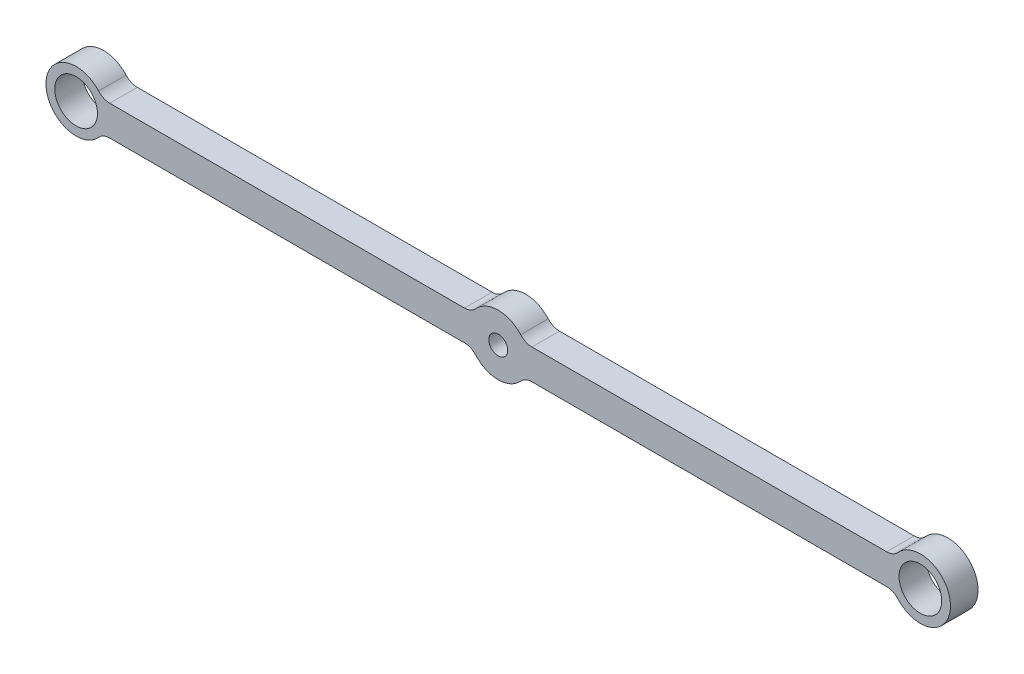
ISO-10303-21;
HEADER;
FILE_DESCRIPTION(('STEP AP214'),'2;1');
FILE_NAME('part.step','',(''),(''),'','','');
FILE_SCHEMA(('AUTOMOTIVE_DESIGN { 1 0 10303 214 1 1 1 1 }'));
ENDSEC;
DATA;
#1=APPLICATION_CONTEXT('core data for automotive mechanical design processes');
#2=APPLICATION_PROTOCOL_DEFINITION('international standard','automotive_design',2000,#1);
#3=PRODUCT_CONTEXT('',#1,'mechanical');
#4=PRODUCT('Part','Part','',(#3));
#5=PRODUCT_RELATED_PRODUCT_CATEGORY('part','',(#4));
#6=PRODUCT_DEFINITION_FORMATION('','',#4);
#7=PRODUCT_DEFINITION_CONTEXT('part definition',#1,'design');
#8=PRODUCT_DEFINITION('design','',#6,#7);
#9=PRODUCT_DEFINITION_SHAPE('','',#8);
#10=(LENGTH_UNIT() NAMED_UNIT(*) SI_UNIT(.MILLI.,.METRE.));
#11=(NAMED_UNIT(*) PLANE_ANGLE_UNIT() SI_UNIT($,.RADIAN.));
#12=(NAMED_UNIT(*) SI_UNIT($,.STERADIAN.) SOLID_ANGLE_UNIT());
#13=UNCERTAINTY_MEASURE_WITH_UNIT(LENGTH_MEASURE(1.E-05),#10,'distance_accuracy_value','');
#14=(GEOMETRIC_REPRESENTATION_CONTEXT(3) GLOBAL_UNCERTAINTY_ASSIGNED_CONTEXT((#13)) GLOBAL_UNIT_ASSIGNED_CONTEXT((#10,
#11,#12)) REPRESENTATION_CONTEXT('',''));
#15=CARTESIAN_POINT('',(0.,0.,0.));
#16=DIRECTION('',(0.,0.,1.));
#17=DIRECTION('',(1.,0.,0.));
#18=AXIS2_PLACEMENT_3D('',#15,#16,#17);
#19=CARTESIAN_POINT('',(-88.9000000000009,0.,5.80136));
#20=DIRECTION('',(0.,0.,-1.));
#21=DIRECTION('',(-1.,0.,0.));
#22=AXIS2_PLACEMENT_3D('',#19,#20,#21);
#23=CYLINDRICAL_SURFACE('',#22,6.35);
#24=CARTESIAN_POINT('',(-88.9000000000009,0.,0.));
#25=DIRECTION('',(0.,0.,1.));
#26=DIRECTION('',(1.,0.,0.));
#27=AXIS2_PLACEMENT_3D('',#24,#25,#26);
#28=CIRCLE('',#27,6.35);
#29=CARTESIAN_POINT('',(-84.1669894476263,4.23333333333326,0.));
#30=VERTEX_POINT('',#29);
#31=CARTESIAN_POINT('',(-84.1669894476263,-4.23333333333339,0.));
#32=VERTEX_POINT('',#31);
#33=EDGE_CURVE('E180',#30,#32,#28,.T.);
#34=ORIENTED_EDGE('',*,*,#33,.T.);
#35=DIRECTION('',(0.,0.,-1.));
#36=VECTOR('',#35,1.);
#37=CARTESIAN_POINT('',(-84.1669894476263,-4.23333333333339,5.80136));
#38=LINE('',#37,#36);
#39=CARTESIAN_POINT('',(-84.1669894476263,-4.23333333333339,5.80136));
#40=VERTEX_POINT('',#39);
#41=EDGE_CURVE('E157',#32,#40,#38,.F.);
#42=ORIENTED_EDGE('',*,*,#41,.T.);
#43=CARTESIAN_POINT('',(-88.9000000000009,0.,5.80136));
#44=DIRECTION('',(0.,0.,1.));
#45=DIRECTION('',(1.,0.,0.));
#46=AXIS2_PLACEMENT_3D('',#43,#44,#45);
#47=CIRCLE('',#46,6.35);
#48=CARTESIAN_POINT('',(-84.1669894476263,4.23333333333326,5.80136));
#49=VERTEX_POINT('',#48);
#50=EDGE_CURVE('E209',#49,#40,#47,.T.);
#51=ORIENTED_EDGE('',*,*,#50,.F.);
#52=DIRECTION('',(0.,0.,-1.));
#53=VECTOR('',#52,1.);
#54=CARTESIAN_POINT('',(-84.1669894476263,4.23333333333326,5.80136));
#55=LINE('',#54,#53);
#56=EDGE_CURVE('E172',#49,#30,#55,.T.);
#57=ORIENTED_EDGE('',*,*,#56,.T.);
#58=EDGE_LOOP('',(#34,#42,#51,#57));
#59=FACE_BOUND('',#58,.T.);
#60=ADVANCED_FACE('F38',(#59),#23,.T.);
#61=CARTESIAN_POINT('',(0.,-3.17500000000005,5.80136));
#62=DIRECTION('',(0.,1.,0.));
#63=DIRECTION('',(0.,0.,1.));
#64=AXIS2_PLACEMENT_3D('',#61,#62,#63);
#65=PLANE('',#64);
#66=DIRECTION('',(1.,0.,0.));
#67=VECTOR('',#66,1.);
#68=CARTESIAN_POINT('',(0.,-3.17500000000005,5.80136));
#69=LINE('',#68,#67);
#70=CARTESIAN_POINT('',(-81.800484171439,-3.17500000000005,5.80136));
#71=VERTEX_POINT('',#70);
#72=CARTESIAN_POINT('',(-7.09951582856257,-3.17500000000005,5.80136));
#73=VERTEX_POINT('',#72);
#74=EDGE_CURVE('E171',#71,#73,#69,.T.);
#75=ORIENTED_EDGE('',*,*,#74,.F.);
#76=DIRECTION('',(0.,0.,1.));
#77=VECTOR('',#76,1.);
#78=CARTESIAN_POINT('',(-81.800484171439,-3.17500000000005,0.));
#79=LINE('',#78,#77);
#80=CARTESIAN_POINT('',(-81.800484171439,-3.17500000000005,0.));
#81=VERTEX_POINT('',#80);
#82=EDGE_CURVE('E156',#71,#81,#79,.F.);
#83=ORIENTED_EDGE('',*,*,#82,.T.);
#84=DIRECTION('',(1.,0.,0.));
#85=VECTOR('',#84,1.);
#86=CARTESIAN_POINT('',(0.,-3.17500000000005,0.));
#87=LINE('',#86,#85);
#88=CARTESIAN_POINT('',(-7.09951582856257,-3.17500000000005,0.));
#89=VERTEX_POINT('',#88);
#90=EDGE_CURVE('E168',#81,#89,#87,.T.);
#91=ORIENTED_EDGE('',*,*,#90,.T.);
#92=DIRECTION('',(0.,0.,1.));
#93=VECTOR('',#92,1.);
#94=CARTESIAN_POINT('',(-7.09951582856257,-3.17500000000005,5.80136));
#95=LINE('',#94,#93);
#96=EDGE_CURVE('E173',#89,#73,#95,.T.);
#97=ORIENTED_EDGE('',*,*,#96,.T.);
#98=EDGE_LOOP('',(#75,#83,#91,#97));
#99=FACE_BOUND('',#98,.T.);
#100=ADVANCED_FACE('F167',(#99),#65,.F.);
#101=CARTESIAN_POINT('',(-8.60422844084496E-13,0.,5.80136));
#102=DIRECTION('',(0.,0.,-1.));
#103=DIRECTION('',(-1.,0.,0.));
#104=AXIS2_PLACEMENT_3D('',#101,#102,#103);
#105=CYLINDRICAL_SURFACE('',#104,6.34999999999994);
#106=CARTESIAN_POINT('',(-8.60422844084496E-13,0.,0.));
#107=DIRECTION('',(0.,0.,1.));
#108=DIRECTION('',(1.,0.,0.));
#109=AXIS2_PLACEMENT_3D('',#106,#107,#108);
#110=CIRCLE('',#109,6.34999999999994);
#111=CARTESIAN_POINT('',(-4.73301055237532,-4.23333333333336,0.));
#112=VERTEX_POINT('',#111);
#113=CARTESIAN_POINT('',(4.7330105523736,-4.23333333333336,0.));
#114=VERTEX_POINT('',#113);
#115=EDGE_CURVE('E179',#112,#114,#110,.T.);
#116=ORIENTED_EDGE('',*,*,#115,.T.);
#117=DIRECTION('',(0.,0.,-1.));
#118=VECTOR('',#117,1.);
#119=CARTESIAN_POINT('',(4.7330105523736,-4.23333333333336,5.80136));
#120=LINE('',#119,#118);
#121=CARTESIAN_POINT('',(4.7330105523736,-4.23333333333336,5.80136));
#122=VERTEX_POINT('',#121);
#123=EDGE_CURVE('E223',#114,#122,#120,.F.);
#124=ORIENTED_EDGE('',*,*,#123,.T.);
#125=CARTESIAN_POINT('',(-8.60422844084496E-13,0.,5.80136));
#126=DIRECTION('',(0.,0.,1.));
#127=DIRECTION('',(1.,0.,0.));
#128=AXIS2_PLACEMENT_3D('',#125,#126,#127);
#129=CIRCLE('',#128,6.34999999999994);
#130=CARTESIAN_POINT('',(-4.73301055237532,-4.23333333333336,5.80136));
#131=VERTEX_POINT('',#130);
#132=EDGE_CURVE('E283',#131,#122,#129,.T.);
#133=ORIENTED_EDGE('',*,*,#132,.F.);
#134=DIRECTION('',(0.,0.,-1.));
#135=VECTOR('',#134,1.);
#136=CARTESIAN_POINT('',(-4.73301055237532,-4.23333333333336,5.80136));
#137=LINE('',#136,#135);
#138=EDGE_CURVE('E220',#131,#112,#137,.T.);
#139=ORIENTED_EDGE('',*,*,#138,.T.);
#140=EDGE_LOOP('',(#116,#124,#133,#139));
#141=FACE_BOUND('',#140,.T.);
#142=ADVANCED_FACE('F322',(#141),#105,.T.);
#143=CARTESIAN_POINT('',(0.,-3.17500000000005,5.80136));
#144=DIRECTION('',(0.,1.,0.));
#145=DIRECTION('',(-1.,0.,0.));
#146=AXIS2_PLACEMENT_3D('',#143,#144,#145);
#147=PLANE('',#146);
#148=DIRECTION('',(1.,0.,0.));
#149=VECTOR('',#148,1.);
#150=CARTESIAN_POINT('',(0.,-3.17500000000005,5.80136));
#151=LINE('',#150,#149);
#152=CARTESIAN_POINT('',(7.09951582856085,-3.17500000000005,5.80136));
#153=VERTEX_POINT('',#152);
#154=CARTESIAN_POINT('',(81.8004841714374,-3.17500000000006,5.80136));
#155=VERTEX_POINT('',#154);
#156=EDGE_CURVE('E289',#153,#155,#151,.T.);
#157=ORIENTED_EDGE('',*,*,#156,.F.);
#158=DIRECTION('',(0.,0.,1.));
#159=VECTOR('',#158,1.);
#160=CARTESIAN_POINT('',(7.09951582856085,-3.17500000000005,0.));
#161=LINE('',#160,#159);
#162=CARTESIAN_POINT('',(7.09951582856085,-3.17500000000005,0.));
#163=VERTEX_POINT('',#162);
#164=EDGE_CURVE('E217',#153,#163,#161,.F.);
#165=ORIENTED_EDGE('',*,*,#164,.T.);
#166=DIRECTION('',(1.,0.,0.));
#167=VECTOR('',#166,1.);
#168=CARTESIAN_POINT('',(0.,-3.17500000000005,0.));
#169=LINE('',#168,#167);
#170=CARTESIAN_POINT('',(81.8004841714374,-3.17500000000006,0.));
#171=VERTEX_POINT('',#170);
#172=EDGE_CURVE('E183',#163,#171,#169,.T.);
#173=ORIENTED_EDGE('',*,*,#172,.T.);
#174=DIRECTION('',(0.,0.,1.));
#175=VECTOR('',#174,1.);
#176=CARTESIAN_POINT('',(81.8004841714374,-3.17500000000006,5.80136));
#177=LINE('',#176,#175);
#178=EDGE_CURVE('E215',#171,#155,#177,.T.);
#179=ORIENTED_EDGE('',*,*,#178,.T.);
#180=EDGE_LOOP('',(#157,#165,#173,#179));
#181=FACE_BOUND('',#180,.T.);
#182=ADVANCED_FACE('F374',(#181),#147,.F.);
#183=CARTESIAN_POINT('',(88.8999999999991,0.,5.80136));
#184=DIRECTION('',(0.,0.,-1.));
#185=DIRECTION('',(-1.,0.,0.));
#186=AXIS2_PLACEMENT_3D('',#183,#184,#185);
#187=CYLINDRICAL_SURFACE('',#186,6.35);
#188=CARTESIAN_POINT('',(88.8999999999991,0.,5.80136));
#189=DIRECTION('',(0.,0.,1.));
#190=DIRECTION('',(1.,0.,0.));
#191=AXIS2_PLACEMENT_3D('',#188,#189,#190);
#192=CIRCLE('',#191,6.35);
#193=CARTESIAN_POINT('',(84.1669894476246,-4.23333333333337,5.80136));
#194=VERTEX_POINT('',#193);
#195=CARTESIAN_POINT('',(84.1669894476245,4.23333333333329,5.80136));
#196=VERTEX_POINT('',#195);
#197=EDGE_CURVE('E292',#194,#196,#192,.T.);
#198=ORIENTED_EDGE('',*,*,#197,.F.);
#199=DIRECTION('',(0.,0.,-1.));
#200=VECTOR('',#199,1.);
#201=CARTESIAN_POINT('',(84.1669894476246,-4.23333333333337,5.80136));
#202=LINE('',#201,#200);
#203=CARTESIAN_POINT('',(84.1669894476246,-4.23333333333337,0.));
#204=VERTEX_POINT('',#203);
#205=EDGE_CURVE('E227',#194,#204,#202,.T.);
#206=ORIENTED_EDGE('',*,*,#205,.T.);
#207=CARTESIAN_POINT('',(88.8999999999991,0.,0.));
#208=DIRECTION('',(0.,0.,1.));
#209=DIRECTION('',(1.,0.,0.));
#210=AXIS2_PLACEMENT_3D('',#207,#208,#209);
#211=CIRCLE('',#210,6.35);
#212=CARTESIAN_POINT('',(84.1669894476245,4.23333333333329,0.));
#213=VERTEX_POINT('',#212);
#214=EDGE_CURVE('E193',#204,#213,#211,.T.);
#215=ORIENTED_EDGE('',*,*,#214,.T.);
#216=DIRECTION('',(0.,0.,-1.));
#217=VECTOR('',#216,1.);
#218=CARTESIAN_POINT('',(84.1669894476245,4.23333333333329,5.80136));
#219=LINE('',#218,#217);
#220=EDGE_CURVE('E225',#213,#196,#219,.F.);
#221=ORIENTED_EDGE('',*,*,#220,.T.);
#222=EDGE_LOOP('',(#198,#206,#215,#221));
#223=FACE_BOUND('',#222,.T.);
#224=ADVANCED_FACE('F367',(#223),#187,.T.);
#225=CARTESIAN_POINT('',(0.,3.17499999999994,5.80136));
#226=DIRECTION('',(0.,1.,0.));
#227=DIRECTION('',(0.,0.,1.));
#228=AXIS2_PLACEMENT_3D('',#225,#226,#227);
#229=PLANE('',#228);
#230=DIRECTION('',(1.,0.,0.));
#231=VECTOR('',#230,1.);
#232=CARTESIAN_POINT('',(0.,3.17499999999994,5.80136));
#233=LINE('',#232,#231);
#234=CARTESIAN_POINT('',(7.09951582856095,3.17499999999994,5.80136));
#235=VERTEX_POINT('',#234);
#236=CARTESIAN_POINT('',(81.8004841714373,3.17499999999994,5.80136));
#237=VERTEX_POINT('',#236);
#238=EDGE_CURVE('E288',#235,#237,#233,.T.);
#239=ORIENTED_EDGE('',*,*,#238,.T.);
#240=DIRECTION('',(0.,0.,-1.));
#241=VECTOR('',#240,1.);
#242=CARTESIAN_POINT('',(81.8004841714373,3.17499999999994,5.80136));
#243=LINE('',#242,#241);
#244=CARTESIAN_POINT('',(81.8004841714373,3.17499999999994,0.));
#245=VERTEX_POINT('',#244);
#246=EDGE_CURVE('E232',#237,#245,#243,.T.);
#247=ORIENTED_EDGE('',*,*,#246,.T.);
#248=DIRECTION('',(1.,0.,0.));
#249=VECTOR('',#248,1.);
#250=CARTESIAN_POINT('',(0.,3.17499999999994,0.));
#251=LINE('',#250,#249);
#252=CARTESIAN_POINT('',(7.09951582856095,3.17499999999994,0.));
#253=VERTEX_POINT('',#252);
#254=EDGE_CURVE('E190',#253,#245,#251,.T.);
#255=ORIENTED_EDGE('',*,*,#254,.F.);
#256=DIRECTION('',(0.,0.,-1.));
#257=VECTOR('',#256,1.);
#258=CARTESIAN_POINT('',(7.09951582856095,3.17499999999994,5.80136));
#259=LINE('',#258,#257);
#260=EDGE_CURVE('E230',#253,#235,#259,.F.);
#261=ORIENTED_EDGE('',*,*,#260,.T.);
#262=EDGE_LOOP('',(#239,#247,#255,#261));
#263=FACE_BOUND('',#262,.T.);
#264=ADVANCED_FACE('F360',(#263),#229,.T.);
#265=CARTESIAN_POINT('',(4.73301055237366,4.23333333333328,0.));
#266=VERTEX_POINT('',#265);
#267=CARTESIAN_POINT('',(-4.73301055237538,4.23333333333328,0.));
#268=VERTEX_POINT('',#267);
#269=EDGE_CURVE('E185',#266,#268,#110,.T.);
#270=ORIENTED_EDGE('',*,*,#269,.T.);
#271=DIRECTION('',(0.,0.,-1.));
#272=VECTOR('',#271,1.);
#273=CARTESIAN_POINT('',(-4.73301055237538,4.23333333333328,5.80136));
#274=LINE('',#273,#272);
#275=CARTESIAN_POINT('',(-4.73301055237538,4.23333333333328,5.80136));
#276=VERTEX_POINT('',#275);
#277=EDGE_CURVE('E53',#268,#276,#274,.F.);
#278=ORIENTED_EDGE('',*,*,#277,.T.);
#279=CARTESIAN_POINT('',(4.73301055237366,4.23333333333328,5.80136));
#280=VERTEX_POINT('',#279);
#281=EDGE_CURVE('E286',#280,#276,#129,.T.);
#282=ORIENTED_EDGE('',*,*,#281,.F.);
#283=DIRECTION('',(0.,0.,-1.));
#284=VECTOR('',#283,1.);
#285=CARTESIAN_POINT('',(4.73301055237366,4.23333333333328,5.80136));
#286=LINE('',#285,#284);
#287=EDGE_CURVE('E240',#280,#266,#286,.T.);
#288=ORIENTED_EDGE('',*,*,#287,.T.);
#289=EDGE_LOOP('',(#270,#278,#282,#288));
#290=FACE_BOUND('',#289,.T.);
#291=ADVANCED_FACE('F356',(#290),#105,.T.);
#292=CARTESIAN_POINT('',(-88.9000000000009,0.,5.80136));
#293=DIRECTION('',(0.,0.,-1.));
#294=DIRECTION('',(-1.,0.,0.));
#295=AXIS2_PLACEMENT_3D('',#292,#293,#294);
#296=CYLINDRICAL_SURFACE('',#295,4.49961);
#297=CARTESIAN_POINT('',(-88.9000000000009,0.,5.80136));
#298=DIRECTION('',(0.,0.,1.));
#299=DIRECTION('',(1.,0.,0.));
#300=AXIS2_PLACEMENT_3D('',#297,#298,#299);
#301=CIRCLE('',#300,4.49961);
#302=CARTESIAN_POINT('',(-84.4003900000009,0.,5.80136));
#303=VERTEX_POINT('',#302);
#304=EDGE_CURVE('E301',#303,#303,#301,.T.);
#305=ORIENTED_EDGE('',*,*,#304,.T.);
#306=EDGE_LOOP('',(#305));
#307=FACE_BOUND('',#306,.T.);
#308=CARTESIAN_POINT('',(-88.9000000000009,0.,0.));
#309=DIRECTION('',(0.,0.,1.));
#310=DIRECTION('',(1.,0.,0.));
#311=AXIS2_PLACEMENT_3D('',#308,#309,#310);
#312=CIRCLE('',#311,4.49961);
#313=CARTESIAN_POINT('',(-84.4003900000009,0.,0.));
#314=VERTEX_POINT('',#313);
#315=EDGE_CURVE('E203',#314,#314,#312,.T.);
#316=ORIENTED_EDGE('',*,*,#315,.F.);
#317=EDGE_LOOP('',(#316));
#318=FACE_BOUND('',#317,.T.);
#319=ADVANCED_FACE('F391',(#307,#318),#296,.F.);
#320=CARTESIAN_POINT('',(88.8999999999991,0.,5.80136));
#321=DIRECTION('',(0.,0.,-1.));
#322=DIRECTION('',(-1.,0.,0.));
#323=AXIS2_PLACEMENT_3D('',#320,#321,#322);
#324=CYLINDRICAL_SURFACE('',#323,4.49961);
#325=CARTESIAN_POINT('',(88.8999999999991,0.,5.80136));
#326=DIRECTION('',(0.,0.,1.));
#327=DIRECTION('',(1.,0.,0.));
#328=AXIS2_PLACEMENT_3D('',#325,#326,#327);
#329=CIRCLE('',#328,4.49961);
#330=CARTESIAN_POINT('',(93.3996099999991,0.,5.80136));
#331=VERTEX_POINT('',#330);
#332=EDGE_CURVE('E298',#331,#331,#329,.T.);
#333=ORIENTED_EDGE('',*,*,#332,.T.);
#334=EDGE_LOOP('',(#333));
#335=FACE_BOUND('',#334,.T.);
#336=CARTESIAN_POINT('',(88.8999999999991,0.,0.));
#337=DIRECTION('',(0.,0.,1.));
#338=DIRECTION('',(1.,0.,0.));
#339=AXIS2_PLACEMENT_3D('',#336,#337,#338);
#340=CIRCLE('',#339,4.49961);
#341=CARTESIAN_POINT('',(93.3996099999991,0.,0.));
#342=VERTEX_POINT('',#341);
#343=EDGE_CURVE('E200',#342,#342,#340,.T.);
#344=ORIENTED_EDGE('',*,*,#343,.F.);
#345=EDGE_LOOP('',(#344));
#346=FACE_BOUND('',#345,.T.);
#347=ADVANCED_FACE('F396',(#335,#346),#324,.F.);
#348=CARTESIAN_POINT('',(0.,3.17499999999994,5.80136));
#349=DIRECTION('',(0.,1.,0.));
#350=DIRECTION('',(0.,0.,1.));
#351=AXIS2_PLACEMENT_3D('',#348,#349,#350);
#352=PLANE('',#351);
#353=DIRECTION('',(1.,0.,0.));
#354=VECTOR('',#353,1.);
#355=CARTESIAN_POINT('',(0.,3.17499999999994,5.80136));
#356=LINE('',#355,#354);
#357=CARTESIAN_POINT('',(-81.800484171439,3.17499999999994,5.80136));
#358=VERTEX_POINT('',#357);
#359=CARTESIAN_POINT('',(-7.09951582856267,3.17499999999994,5.80136));
#360=VERTEX_POINT('',#359);
#361=EDGE_CURVE('E280',#358,#360,#356,.T.);
#362=ORIENTED_EDGE('',*,*,#361,.T.);
#363=DIRECTION('',(0.,0.,-1.));
#364=VECTOR('',#363,1.);
#365=CARTESIAN_POINT('',(-7.09951582856267,3.17499999999994,5.80136));
#366=LINE('',#365,#364);
#367=CARTESIAN_POINT('',(-7.09951582856267,3.17499999999994,0.));
#368=VERTEX_POINT('',#367);
#369=EDGE_CURVE('E237',#360,#368,#366,.T.);
#370=ORIENTED_EDGE('',*,*,#369,.T.);
#371=DIRECTION('',(1.,0.,0.));
#372=VECTOR('',#371,1.);
#373=CARTESIAN_POINT('',(0.,3.17499999999994,0.));
#374=LINE('',#373,#372);
#375=CARTESIAN_POINT('',(-81.800484171439,3.17499999999994,0.));
#376=VERTEX_POINT('',#375);
#377=EDGE_CURVE('E189',#376,#368,#374,.T.);
#378=ORIENTED_EDGE('',*,*,#377,.F.);
#379=DIRECTION('',(0.,0.,-1.));
#380=VECTOR('',#379,1.);
#381=CARTESIAN_POINT('',(-81.800484171439,3.17499999999994,5.80136));
#382=LINE('',#381,#380);
#383=EDGE_CURVE('E235',#376,#358,#382,.F.);
#384=ORIENTED_EDGE('',*,*,#383,.T.);
#385=EDGE_LOOP('',(#362,#370,#378,#384));
#386=FACE_BOUND('',#385,.T.);
#387=ADVANCED_FACE('F272',(#386),#352,.T.);
#388=CARTESIAN_POINT('',(-8.60422844084496E-13,0.,5.80136));
#389=DIRECTION('',(0.,0.,-1.));
#390=DIRECTION('',(-1.,0.,0.));
#391=AXIS2_PLACEMENT_3D('',#388,#389,#390);
#392=CYLINDRICAL_SURFACE('',#391,1.9939);
#393=CARTESIAN_POINT('',(-8.60422844084496E-13,0.,5.80136));
#394=DIRECTION('',(0.,0.,1.));
#395=DIRECTION('',(1.,0.,0.));
#396=AXIS2_PLACEMENT_3D('',#393,#394,#395);
#397=CIRCLE('',#396,1.9939);
#398=CARTESIAN_POINT('',(1.99389999999914,0.,5.80136));
#399=VERTEX_POINT('',#398);
#400=EDGE_CURVE('E210',#399,#399,#397,.T.);
#401=ORIENTED_EDGE('',*,*,#400,.T.);
#402=EDGE_LOOP('',(#401));
#403=FACE_BOUND('',#402,.T.);
#404=CARTESIAN_POINT('',(-8.60422844084496E-13,0.,0.));
#405=DIRECTION('',(0.,0.,1.));
#406=DIRECTION('',(1.,0.,0.));
#407=AXIS2_PLACEMENT_3D('',#404,#405,#406);
#408=CIRCLE('',#407,1.9939);
#409=CARTESIAN_POINT('',(1.99389999999914,0.,0.));
#410=VERTEX_POINT('',#409);
#411=EDGE_CURVE('E206',#410,#410,#408,.T.);
#412=ORIENTED_EDGE('',*,*,#411,.F.);
#413=EDGE_LOOP('',(#412));
#414=FACE_BOUND('',#413,.T.);
#415=ADVANCED_FACE('F306',(#403,#414),#392,.F.);
#416=CARTESIAN_POINT('',(0.,0.,5.80136));
#417=DIRECTION('',(0.,0.,1.));
#418=DIRECTION('',(1.,0.,0.));
#419=AXIS2_PLACEMENT_3D('',#416,#417,#418);
#420=PLANE('',#419);
#421=ORIENTED_EDGE('',*,*,#361,.F.);
#422=CARTESIAN_POINT('',(-81.800484171439,6.34999999999994,5.80136));
#423=DIRECTION('',(0.,0.,1.));
#424=DIRECTION('',(1.,0.,0.));
#425=AXIS2_PLACEMENT_3D('',#422,#423,#424);
#426=CIRCLE('',#425,3.175);
#427=EDGE_CURVE('E11',#358,#49,#426,.F.);
#428=ORIENTED_EDGE('',*,*,#427,.T.);
#429=ORIENTED_EDGE('',*,*,#50,.T.);
#430=CARTESIAN_POINT('',(-81.800484171439,-6.35000000000005,5.80136));
#431=DIRECTION('',(0.,0.,1.));
#432=DIRECTION('',(1.,0.,0.));
#433=AXIS2_PLACEMENT_3D('',#430,#431,#432);
#434=CIRCLE('',#433,3.175);
#435=EDGE_CURVE('E162',#40,#71,#434,.F.);
#436=ORIENTED_EDGE('',*,*,#435,.T.);
#437=ORIENTED_EDGE('',*,*,#74,.T.);
#438=CARTESIAN_POINT('',(-7.09951582856257,-6.35000000000005,5.80136));
#439=DIRECTION('',(0.,0.,1.));
#440=DIRECTION('',(1.,0.,0.));
#441=AXIS2_PLACEMENT_3D('',#438,#439,#440);
#442=CIRCLE('',#441,3.175);
#443=EDGE_CURVE('E250',#73,#131,#442,.F.);
#444=ORIENTED_EDGE('',*,*,#443,.T.);
#445=ORIENTED_EDGE('',*,*,#132,.T.);
#446=CARTESIAN_POINT('',(7.09951582856085,-6.35000000000006,5.80136));
#447=DIRECTION('',(0.,0.,1.));
#448=DIRECTION('',(1.,0.,0.));
#449=AXIS2_PLACEMENT_3D('',#446,#447,#448);
#450=CIRCLE('',#449,3.175);
#451=EDGE_CURVE('E247',#122,#153,#450,.F.);
#452=ORIENTED_EDGE('',*,*,#451,.T.);
#453=ORIENTED_EDGE('',*,*,#156,.T.);
#454=CARTESIAN_POINT('',(81.8004841714374,-6.35000000000006,5.80136));
#455=DIRECTION('',(0.,0.,1.));
#456=DIRECTION('',(1.,0.,0.));
#457=AXIS2_PLACEMENT_3D('',#454,#455,#456);
#458=CIRCLE('',#457,3.175);
#459=EDGE_CURVE('E254',#155,#194,#458,.F.);
#460=ORIENTED_EDGE('',*,*,#459,.T.);
#461=ORIENTED_EDGE('',*,*,#197,.T.);
#462=CARTESIAN_POINT('',(81.8004841714373,6.34999999999994,5.80136));
#463=DIRECTION('',(0.,0.,1.));
#464=DIRECTION('',(1.,0.,0.));
#465=AXIS2_PLACEMENT_3D('',#462,#463,#464);
#466=CIRCLE('',#465,3.175);
#467=EDGE_CURVE('E258',#196,#237,#466,.F.);
#468=ORIENTED_EDGE('',*,*,#467,.T.);
#469=ORIENTED_EDGE('',*,*,#238,.F.);
#470=CARTESIAN_POINT('',(7.09951582856095,6.34999999999994,5.80136));
#471=DIRECTION('',(0.,0.,1.));
#472=DIRECTION('',(1.,0.,0.));
#473=AXIS2_PLACEMENT_3D('',#470,#471,#472);
#474=CIRCLE('',#473,3.175);
#475=EDGE_CURVE('E60',#235,#280,#474,.F.);
#476=ORIENTED_EDGE('',*,*,#475,.T.);
#477=ORIENTED_EDGE('',*,*,#281,.T.);
#478=CARTESIAN_POINT('',(-7.09951582856267,6.34999999999994,5.80136));
#479=DIRECTION('',(0.,0.,1.));
#480=DIRECTION('',(1.,0.,0.));
#481=AXIS2_PLACEMENT_3D('',#478,#479,#480);
#482=CIRCLE('',#481,3.175);
#483=EDGE_CURVE('E262',#276,#360,#482,.F.);
#484=ORIENTED_EDGE('',*,*,#483,.T.);
#485=EDGE_LOOP('',(#421,#428,#429,#436,#437,#444,#445,#452,#453,#460,#461,#468,#469,#476,#477,#484));
#486=FACE_BOUND('',#485,.T.);
#487=ORIENTED_EDGE('',*,*,#332,.F.);
#488=EDGE_LOOP('',(#487));
#489=FACE_BOUND('',#488,.T.);
#490=ORIENTED_EDGE('',*,*,#304,.F.);
#491=EDGE_LOOP('',(#490));
#492=FACE_BOUND('',#491,.T.);
#493=ORIENTED_EDGE('',*,*,#400,.F.);
#494=EDGE_LOOP('',(#493));
#495=FACE_BOUND('',#494,.T.);
#496=ADVANCED_FACE('F278',(#486,#489,#492,#495),#420,.T.);
#497=CARTESIAN_POINT('',(0.,0.,0.));
#498=DIRECTION('',(0.,0.,1.));
#499=DIRECTION('',(1.,0.,0.));
#500=AXIS2_PLACEMENT_3D('',#497,#498,#499);
#501=PLANE('',#500);
#502=ORIENTED_EDGE('',*,*,#33,.F.);
#503=CARTESIAN_POINT('',(-81.800484171439,6.34999999999994,0.));
#504=DIRECTION('',(0.,0.,1.));
#505=DIRECTION('',(1.,0.,0.));
#506=AXIS2_PLACEMENT_3D('',#503,#504,#505);
#507=CIRCLE('',#506,3.175);
#508=EDGE_CURVE('E46',#30,#376,#507,.T.);
#509=ORIENTED_EDGE('',*,*,#508,.T.);
#510=ORIENTED_EDGE('',*,*,#377,.T.);
#511=CARTESIAN_POINT('',(-7.09951582856267,6.34999999999994,0.));
#512=DIRECTION('',(0.,0.,1.));
#513=DIRECTION('',(1.,0.,0.));
#514=AXIS2_PLACEMENT_3D('',#511,#512,#513);
#515=CIRCLE('',#514,3.175);
#516=EDGE_CURVE('E260',#368,#268,#515,.T.);
#517=ORIENTED_EDGE('',*,*,#516,.T.);
#518=ORIENTED_EDGE('',*,*,#269,.F.);
#519=CARTESIAN_POINT('',(7.09951582856095,6.34999999999994,0.));
#520=DIRECTION('',(0.,0.,1.));
#521=DIRECTION('',(1.,0.,0.));
#522=AXIS2_PLACEMENT_3D('',#519,#520,#521);
#523=CIRCLE('',#522,3.175);
#524=EDGE_CURVE('E264',#266,#253,#523,.T.);
#525=ORIENTED_EDGE('',*,*,#524,.T.);
#526=ORIENTED_EDGE('',*,*,#254,.T.);
#527=CARTESIAN_POINT('',(81.8004841714373,6.34999999999994,0.));
#528=DIRECTION('',(0.,0.,1.));
#529=DIRECTION('',(1.,0.,0.));
#530=AXIS2_PLACEMENT_3D('',#527,#528,#529);
#531=CIRCLE('',#530,3.175);
#532=EDGE_CURVE('E256',#245,#213,#531,.T.);
#533=ORIENTED_EDGE('',*,*,#532,.T.);
#534=ORIENTED_EDGE('',*,*,#214,.F.);
#535=CARTESIAN_POINT('',(81.8004841714374,-6.35000000000006,0.));
#536=DIRECTION('',(0.,0.,1.));
#537=DIRECTION('',(1.,0.,0.));
#538=AXIS2_PLACEMENT_3D('',#535,#536,#537);
#539=CIRCLE('',#538,3.175);
#540=EDGE_CURVE('E252',#204,#171,#539,.T.);
#541=ORIENTED_EDGE('',*,*,#540,.T.);
#542=ORIENTED_EDGE('',*,*,#172,.F.);
#543=CARTESIAN_POINT('',(7.09951582856085,-6.35000000000006,0.));
#544=DIRECTION('',(0.,0.,1.));
#545=DIRECTION('',(1.,0.,0.));
#546=AXIS2_PLACEMENT_3D('',#543,#544,#545);
#547=CIRCLE('',#546,3.175);
#548=EDGE_CURVE('E245',#163,#114,#547,.T.);
#549=ORIENTED_EDGE('',*,*,#548,.T.);
#550=ORIENTED_EDGE('',*,*,#115,.F.);
#551=CARTESIAN_POINT('',(-7.09951582856257,-6.35000000000005,0.));
#552=DIRECTION('',(0.,0.,1.));
#553=DIRECTION('',(1.,0.,0.));
#554=AXIS2_PLACEMENT_3D('',#551,#552,#553);
#555=CIRCLE('',#554,3.175);
#556=EDGE_CURVE('E178',#112,#89,#555,.T.);
#557=ORIENTED_EDGE('',*,*,#556,.T.);
#558=ORIENTED_EDGE('',*,*,#90,.F.);
#559=CARTESIAN_POINT('',(-81.800484171439,-6.35000000000005,0.));
#560=DIRECTION('',(0.,0.,1.));
#561=DIRECTION('',(1.,0.,0.));
#562=AXIS2_PLACEMENT_3D('',#559,#560,#561);
#563=CIRCLE('',#562,3.175);
#564=EDGE_CURVE('E152',#81,#32,#563,.T.);
#565=ORIENTED_EDGE('',*,*,#564,.T.);
#566=EDGE_LOOP('',(#502,#509,#510,#517,#518,#525,#526,#533,#534,#541,#542,#549,#550,#557,#558,#565));
#567=FACE_BOUND('',#566,.T.);
#568=ORIENTED_EDGE('',*,*,#343,.T.);
#569=EDGE_LOOP('',(#568));
#570=FACE_BOUND('',#569,.T.);
#571=ORIENTED_EDGE('',*,*,#315,.T.);
#572=EDGE_LOOP('',(#571));
#573=FACE_BOUND('',#572,.T.);
#574=ORIENTED_EDGE('',*,*,#411,.T.);
#575=EDGE_LOOP('',(#574));
#576=FACE_BOUND('',#575,.T.);
#577=ADVANCED_FACE('F175',(#567,#570,#573,#576),#501,.F.);
#578=CARTESIAN_POINT('',(-81.800484171439,-6.35000000000005,5.80136));
#579=DIRECTION('',(0.,0.,-1.));
#580=DIRECTION('',(-1.,0.,0.));
#581=AXIS2_PLACEMENT_3D('',#578,#579,#580);
#582=CYLINDRICAL_SURFACE('',#581,3.175);
#583=ORIENTED_EDGE('',*,*,#435,.F.);
#584=ORIENTED_EDGE('',*,*,#41,.F.);
#585=ORIENTED_EDGE('',*,*,#564,.F.);
#586=ORIENTED_EDGE('',*,*,#82,.F.);
#587=EDGE_LOOP('',(#583,#584,#585,#586));
#588=FACE_BOUND('',#587,.T.);
#589=ADVANCED_FACE('F155',(#588),#582,.F.);
#590=CARTESIAN_POINT('',(7.09951582856085,-6.35000000000006,5.80136));
#591=DIRECTION('',(0.,0.,-1.));
#592=DIRECTION('',(-1.,0.,0.));
#593=AXIS2_PLACEMENT_3D('',#590,#591,#592);
#594=CYLINDRICAL_SURFACE('',#593,3.175);
#595=ORIENTED_EDGE('',*,*,#451,.F.);
#596=ORIENTED_EDGE('',*,*,#123,.F.);
#597=ORIENTED_EDGE('',*,*,#548,.F.);
#598=ORIENTED_EDGE('',*,*,#164,.F.);
#599=EDGE_LOOP('',(#595,#596,#597,#598));
#600=FACE_BOUND('',#599,.T.);
#601=ADVANCED_FACE('F328',(#600),#594,.F.);
#602=CARTESIAN_POINT('',(-7.09951582856257,-6.35000000000005,5.80136));
#603=DIRECTION('',(0.,0.,-1.));
#604=DIRECTION('',(-1.,0.,0.));
#605=AXIS2_PLACEMENT_3D('',#602,#603,#604);
#606=CYLINDRICAL_SURFACE('',#605,3.175);
#607=ORIENTED_EDGE('',*,*,#443,.F.);
#608=ORIENTED_EDGE('',*,*,#96,.F.);
#609=ORIENTED_EDGE('',*,*,#556,.F.);
#610=ORIENTED_EDGE('',*,*,#138,.F.);
#611=EDGE_LOOP('',(#607,#608,#609,#610));
#612=FACE_BOUND('',#611,.T.);
#613=ADVANCED_FACE('F331',(#612),#606,.F.);
#614=CARTESIAN_POINT('',(81.8004841714374,-6.35000000000006,5.80136));
#615=DIRECTION('',(0.,0.,-1.));
#616=DIRECTION('',(-1.,0.,0.));
#617=AXIS2_PLACEMENT_3D('',#614,#615,#616);
#618=CYLINDRICAL_SURFACE('',#617,3.175);
#619=ORIENTED_EDGE('',*,*,#459,.F.);
#620=ORIENTED_EDGE('',*,*,#178,.F.);
#621=ORIENTED_EDGE('',*,*,#540,.F.);
#622=ORIENTED_EDGE('',*,*,#205,.F.);
#623=EDGE_LOOP('',(#619,#620,#621,#622));
#624=FACE_BOUND('',#623,.T.);
#625=ADVANCED_FACE('F335',(#624),#618,.F.);
#626=CARTESIAN_POINT('',(81.8004841714373,6.34999999999994,5.80136));
#627=DIRECTION('',(0.,0.,-1.));
#628=DIRECTION('',(-1.,0.,0.));
#629=AXIS2_PLACEMENT_3D('',#626,#627,#628);
#630=CYLINDRICAL_SURFACE('',#629,3.175);
#631=ORIENTED_EDGE('',*,*,#467,.F.);
#632=ORIENTED_EDGE('',*,*,#220,.F.);
#633=ORIENTED_EDGE('',*,*,#532,.F.);
#634=ORIENTED_EDGE('',*,*,#246,.F.);
#635=EDGE_LOOP('',(#631,#632,#633,#634));
#636=FACE_BOUND('',#635,.T.);
#637=ADVANCED_FACE('F339',(#636),#630,.F.);
#638=CARTESIAN_POINT('',(-7.09951582856267,6.34999999999994,5.80136));
#639=DIRECTION('',(0.,0.,-1.));
#640=DIRECTION('',(-1.,0.,0.));
#641=AXIS2_PLACEMENT_3D('',#638,#639,#640);
#642=CYLINDRICAL_SURFACE('',#641,3.175);
#643=ORIENTED_EDGE('',*,*,#483,.F.);
#644=ORIENTED_EDGE('',*,*,#277,.F.);
#645=ORIENTED_EDGE('',*,*,#516,.F.);
#646=ORIENTED_EDGE('',*,*,#369,.F.);
#647=EDGE_LOOP('',(#643,#644,#645,#646));
#648=FACE_BOUND('',#647,.T.);
#649=ADVANCED_FACE('F343',(#648),#642,.F.);
#650=CARTESIAN_POINT('',(7.09951582856095,6.34999999999994,5.80136));
#651=DIRECTION('',(0.,0.,-1.));
#652=DIRECTION('',(-1.,0.,0.));
#653=AXIS2_PLACEMENT_3D('',#650,#651,#652);
#654=CYLINDRICAL_SURFACE('',#653,3.175);
#655=ORIENTED_EDGE('',*,*,#475,.F.);
#656=ORIENTED_EDGE('',*,*,#260,.F.);
#657=ORIENTED_EDGE('',*,*,#524,.F.);
#658=ORIENTED_EDGE('',*,*,#287,.F.);
#659=EDGE_LOOP('',(#655,#656,#657,#658));
#660=FACE_BOUND('',#659,.T.);
#661=ADVANCED_FACE('F346',(#660),#654,.F.);
#662=CARTESIAN_POINT('',(-81.800484171439,6.34999999999994,5.80136));
#663=DIRECTION('',(0.,0.,-1.));
#664=DIRECTION('',(-1.,0.,0.));
#665=AXIS2_PLACEMENT_3D('',#662,#663,#664);
#666=CYLINDRICAL_SURFACE('',#665,3.175);
#667=ORIENTED_EDGE('',*,*,#427,.F.);
#668=ORIENTED_EDGE('',*,*,#383,.F.);
#669=ORIENTED_EDGE('',*,*,#508,.F.);
#670=ORIENTED_EDGE('',*,*,#56,.F.);
#671=EDGE_LOOP('',(#667,#668,#669,#670));
#672=FACE_BOUND('',#671,.T.);
#673=ADVANCED_FACE('F40',(#672),#666,.F.);
#674=CLOSED_SHELL('',(#60,#100,#142,#182,#224,#264,#291,#319,#347,#387,#415,#496,#577,#589,#601,
#613,#625,#637,#649,#661,#673));
#675=MANIFOLD_SOLID_BREP('B2',#674);
#676=ADVANCED_BREP_SHAPE_REPRESENTATION('',(#18,#675),#14);
#677=SHAPE_DEFINITION_REPRESENTATION(#9,#676);
ENDSEC;
END-ISO-10303-21;
